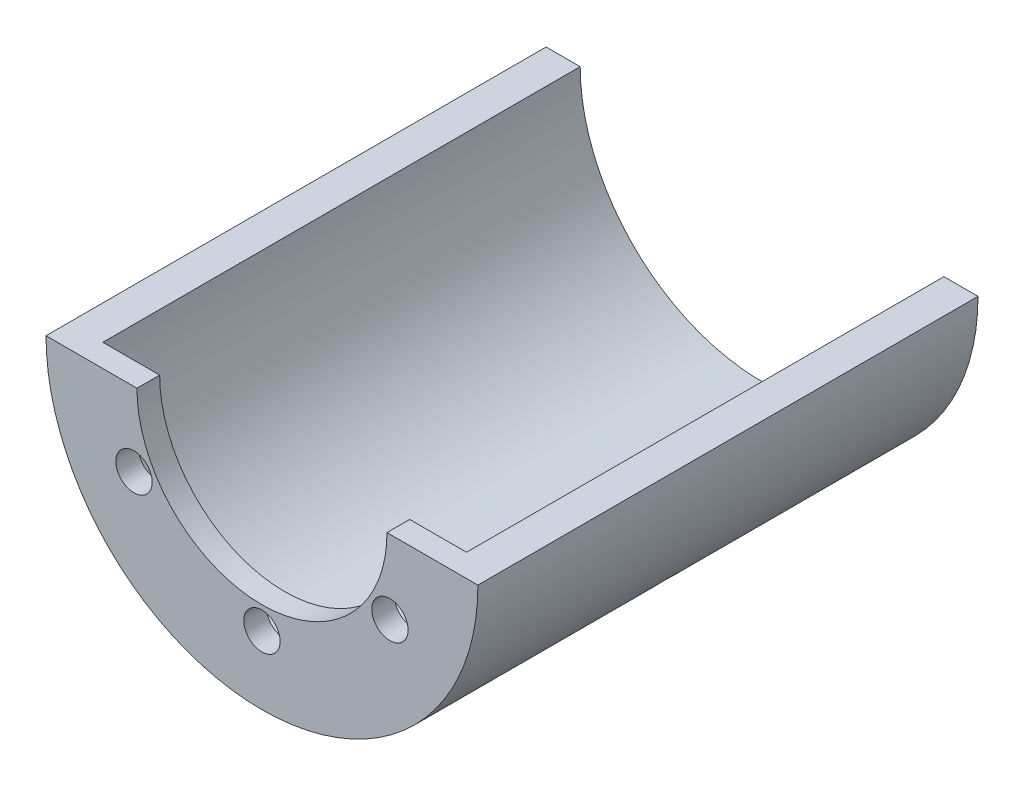
ISO-10303-21;
HEADER;
FILE_DESCRIPTION(('STEP AP214'),'2;1');
FILE_NAME('part.step','',(''),(''),'','','');
FILE_SCHEMA(('AUTOMOTIVE_DESIGN { 1 0 10303 214 1 1 1 1 }'));
ENDSEC;
DATA;
#1=APPLICATION_CONTEXT('core data for automotive mechanical design processes');
#2=APPLICATION_PROTOCOL_DEFINITION('international standard','automotive_design',2000,#1);
#3=PRODUCT_CONTEXT('',#1,'mechanical');
#4=PRODUCT('Part','Part','',(#3));
#5=PRODUCT_RELATED_PRODUCT_CATEGORY('part','',(#4));
#6=PRODUCT_DEFINITION_FORMATION('','',#4);
#7=PRODUCT_DEFINITION_CONTEXT('part definition',#1,'design');
#8=PRODUCT_DEFINITION('design','',#6,#7);
#9=PRODUCT_DEFINITION_SHAPE('','',#8);
#10=(LENGTH_UNIT() NAMED_UNIT(*) SI_UNIT(.MILLI.,.METRE.));
#11=(NAMED_UNIT(*) PLANE_ANGLE_UNIT() SI_UNIT($,.RADIAN.));
#12=(NAMED_UNIT(*) SI_UNIT($,.STERADIAN.) SOLID_ANGLE_UNIT());
#13=UNCERTAINTY_MEASURE_WITH_UNIT(LENGTH_MEASURE(1.E-05),#10,'distance_accuracy_value','');
#14=(GEOMETRIC_REPRESENTATION_CONTEXT(3) GLOBAL_UNCERTAINTY_ASSIGNED_CONTEXT((#13)) GLOBAL_UNIT_ASSIGNED_CONTEXT((#10,
#11,#12)) REPRESENTATION_CONTEXT('',''));
#15=CARTESIAN_POINT('',(0.,0.,0.));
#16=DIRECTION('',(0.,0.,1.));
#17=DIRECTION('',(1.,0.,0.));
#18=AXIS2_PLACEMENT_3D('',#15,#16,#17);
#19=CARTESIAN_POINT('',(-9.5,0.,0.));
#20=DIRECTION('',(0.,-1.,0.));
#21=DIRECTION('',(0.,0.,-1.));
#22=AXIS2_PLACEMENT_3D('',#19,#20,#21);
#23=PLANE('',#22);
#24=DIRECTION('',(-1.,0.,0.));
#25=VECTOR('',#24,1.);
#26=CARTESIAN_POINT('',(0.,0.,21.));
#27=LINE('',#26,#25);
#28=CARTESIAN_POINT('',(8.,0.,21.));
#29=VERTEX_POINT('',#28);
#30=CARTESIAN_POINT('',(5.5,0.,21.));
#31=VERTEX_POINT('',#30);
#32=EDGE_CURVE('E105',#29,#31,#27,.T.);
#33=ORIENTED_EDGE('',*,*,#32,.T.);
#34=DIRECTION('',(0.,0.,1.));
#35=VECTOR('',#34,1.);
#36=CARTESIAN_POINT('',(5.5,0.,0.));
#37=LINE('',#36,#35);
#38=CARTESIAN_POINT('',(5.5,0.,22.));
#39=VERTEX_POINT('',#38);
#40=EDGE_CURVE('E96',#31,#39,#37,.T.);
#41=ORIENTED_EDGE('',*,*,#40,.T.);
#42=DIRECTION('',(-1.,0.,0.));
#43=VECTOR('',#42,1.);
#44=CARTESIAN_POINT('',(0.,0.,22.));
#45=LINE('',#44,#43);
#46=CARTESIAN_POINT('',(9.5,0.,22.));
#47=VERTEX_POINT('',#46);
#48=EDGE_CURVE('E103',#47,#39,#45,.T.);
#49=ORIENTED_EDGE('',*,*,#48,.F.);
#50=DIRECTION('',(0.,0.,1.));
#51=VECTOR('',#50,1.);
#52=CARTESIAN_POINT('',(9.5,0.,0.));
#53=LINE('',#52,#51);
#54=CARTESIAN_POINT('',(9.5,0.,0.));
#55=VERTEX_POINT('',#54);
#56=EDGE_CURVE('E122',#55,#47,#53,.T.);
#57=ORIENTED_EDGE('',*,*,#56,.F.);
#58=DIRECTION('',(1.,0.,0.));
#59=VECTOR('',#58,1.);
#60=CARTESIAN_POINT('',(-9.5,0.,0.));
#61=LINE('',#60,#59);
#62=CARTESIAN_POINT('',(8.,0.,0.));
#63=VERTEX_POINT('',#62);
#64=EDGE_CURVE('E66',#63,#55,#61,.T.);
#65=ORIENTED_EDGE('',*,*,#64,.F.);
#66=DIRECTION('',(0.,0.,1.));
#67=VECTOR('',#66,1.);
#68=CARTESIAN_POINT('',(8.,0.,0.));
#69=LINE('',#68,#67);
#70=EDGE_CURVE('E52',#29,#63,#69,.F.);
#71=ORIENTED_EDGE('',*,*,#70,.F.);
#72=EDGE_LOOP('',(#33,#41,#49,#57,#65,#71));
#73=FACE_BOUND('',#72,.T.);
#74=ADVANCED_FACE('F43',(#73),#23,.F.);
#75=CARTESIAN_POINT('',(0.,0.,21.));
#76=DIRECTION('',(0.,0.,-1.));
#77=DIRECTION('',(-1.,0.,0.));
#78=AXIS2_PLACEMENT_3D('',#75,#76,#77);
#79=CYLINDRICAL_SURFACE('',#78,9.5);
#80=CARTESIAN_POINT('',(0.,0.,0.));
#81=DIRECTION('',(0.,0.,1.));
#82=DIRECTION('',(1.,0.,0.));
#83=AXIS2_PLACEMENT_3D('',#80,#81,#82);
#84=CIRCLE('',#83,9.5);
#85=CARTESIAN_POINT('',(-9.5,0.,0.));
#86=VERTEX_POINT('',#85);
#87=EDGE_CURVE('E130',#86,#55,#84,.T.);
#88=ORIENTED_EDGE('',*,*,#87,.T.);
#89=ORIENTED_EDGE('',*,*,#56,.T.);
#90=CARTESIAN_POINT('',(0.,0.,22.));
#91=DIRECTION('',(0.,0.,1.));
#92=DIRECTION('',(1.,0.,0.));
#93=AXIS2_PLACEMENT_3D('',#90,#91,#92);
#94=CIRCLE('',#93,9.5);
#95=CARTESIAN_POINT('',(-9.5,0.,22.));
#96=VERTEX_POINT('',#95);
#97=EDGE_CURVE('E110',#96,#47,#94,.T.);
#98=ORIENTED_EDGE('',*,*,#97,.F.);
#99=DIRECTION('',(0.,0.,1.));
#100=VECTOR('',#99,1.);
#101=CARTESIAN_POINT('',(-9.5,0.,0.));
#102=LINE('',#101,#100);
#103=EDGE_CURVE('E121',#86,#96,#102,.T.);
#104=ORIENTED_EDGE('',*,*,#103,.F.);
#105=EDGE_LOOP('',(#88,#89,#98,#104));
#106=FACE_BOUND('',#105,.T.);
#107=CARTESIAN_POINT('',(0.,-9.5,10.5));
#108=CARTESIAN_POINT('',(0.02806437374378,-9.49999982417539,10.5000012378692));
#109=CARTESIAN_POINT('',(0.0561486015241214,-9.49987430915388,10.5023707637978));
#110=CARTESIAN_POINT('',(0.111542173551061,-9.4993856714155,10.5117895905077));
#111=CARTESIAN_POINT('',(0.138850567542478,-9.49902226940258,10.5188443922739));
#112=CARTESIAN_POINT('',(0.191882035677595,-9.49809898475712,10.5374311004004));
#113=CARTESIAN_POINT('',(0.217605915366788,-9.4975392029469,10.5489607096953));
#114=CARTESIAN_POINT('',(0.266746275152561,-9.49628618729889,10.5761661820666));
#115=CARTESIAN_POINT('',(0.290163295043532,-9.4955929847936,10.5918410719887));
#116=CARTESIAN_POINT('',(0.334057985296606,-9.49415024136152,10.6269113399686));
#117=CARTESIAN_POINT('',(0.354532789417466,-9.49340064656696,10.6463103035454));
#118=CARTESIAN_POINT('',(0.391937397250838,-9.49193006589218,10.6882708355722));
#119=CARTESIAN_POINT('',(0.40886705552236,-9.49120908118667,10.7108325337113));
#120=CARTESIAN_POINT('',(0.438708940361449,-9.48987663413122,10.7584934312751));
#121=CARTESIAN_POINT('',(0.45161889236729,-9.48926523387266,10.7835940567556));
#122=CARTESIAN_POINT('',(0.473040316223046,-9.48822156888617,10.8356102657882));
#123=CARTESIAN_POINT('',(0.481551824118955,-9.4877893026902,10.8625258344646));
#124=CARTESIAN_POINT('',(0.493927079050541,-9.48715314541049,10.9173812075266));
#125=CARTESIAN_POINT('',(0.497795166530737,-9.48694904106439,10.9453200302044));
#126=CARTESIAN_POINT('',(0.500787173213216,-9.48679158412781,11.0014511171714));
#127=CARTESIAN_POINT('',(0.499911132980883,-9.48683822939327,11.0296433792915));
#128=CARTESIAN_POINT('',(0.493443364229649,-9.487176813379,11.0854515538363));
#129=CARTESIAN_POINT('',(0.487856326687887,-9.48746850809015,11.1130680115974));
#130=CARTESIAN_POINT('',(0.472132429623408,-9.48826393070847,11.1669705353135));
#131=CARTESIAN_POINT('',(0.461995549327281,-9.48876765958374,11.1932565951936));
#132=CARTESIAN_POINT('',(0.437454364376614,-9.48993065858389,11.2437672633556));
#133=CARTESIAN_POINT('',(0.423047923110689,-9.49059000655133,11.2679908316756));
#134=CARTESIAN_POINT('',(0.390378116957728,-9.49198985178424,11.3136775251558));
#135=CARTESIAN_POINT('',(0.372114721748612,-9.49273034968766,11.335140628612));
#136=CARTESIAN_POINT('',(0.332222976424407,-9.49421012015096,11.3747244346757));
#137=CARTESIAN_POINT('',(0.310590564570645,-9.49494939012866,11.3928410442963));
#138=CARTESIAN_POINT('',(0.264589118476257,-9.49634251781153,11.4251860531828));
#139=CARTESIAN_POINT('',(0.240220083514053,-9.49699637549418,11.4394144514235));
#140=CARTESIAN_POINT('',(0.189434727239682,-9.49814502286204,11.4635787620596));
#141=CARTESIAN_POINT('',(0.163018336725353,-9.49863980716753,11.4735145292861));
#142=CARTESIAN_POINT('',(0.108889204661846,-9.49941446923238,11.4888088513594));
#143=CARTESIAN_POINT('',(0.0811764738627556,-9.49969434877353,11.4941674441559));
#144=CARTESIAN_POINT('',(0.0252768524688078,-9.50000743022508,11.5001502568009));
#145=CARTESIAN_POINT('',(-0.00290943067616406,-9.50004092708659,11.5007801375321));
#146=CARTESIAN_POINT('',(-0.058987284177098,-9.49985825150628,11.4973024225252));
#147=CARTESIAN_POINT('',(-0.0868788556145619,-9.49964207998099,11.4931948441782));
#148=CARTESIAN_POINT('',(-0.14155966755875,-9.49898460304193,11.4803634958128));
#149=CARTESIAN_POINT('',(-0.168349516808166,-9.49854342380968,11.4716423129443));
#150=CARTESIAN_POINT('',(-0.220085178079875,-9.49748559511935,11.4498339416642));
#151=CARTESIAN_POINT('',(-0.245030978331784,-9.49686894454137,11.4367467253875));
#152=CARTESIAN_POINT('',(-0.29239640139273,-9.4955287928075,11.4065633078934));
#153=CARTESIAN_POINT('',(-0.314813604855771,-9.49480519082475,11.3894633146517));
#154=CARTESIAN_POINT('',(-0.356461160791032,-9.49333295354143,11.3517452855453));
#155=CARTESIAN_POINT('',(-0.375691490725259,-9.49258431806387,11.3311272248023));
#156=CARTESIAN_POINT('',(-0.410438502169432,-9.49114554822912,11.2869339655433));
#157=CARTESIAN_POINT('',(-0.425951519155961,-9.49045547202879,11.2633558836407));
#158=CARTESIAN_POINT('',(-0.452798497658292,-9.48921255480619,11.213926431084));
#159=CARTESIAN_POINT('',(-0.464132478827489,-9.48865971313852,11.1880750711215));
#160=CARTESIAN_POINT('',(-0.482293274300072,-9.48775402321393,11.1348464271318));
#161=CARTESIAN_POINT('',(-0.48912241901439,-9.48740107156468,11.1074699400345));
#162=CARTESIAN_POINT('',(-0.498087307063366,-9.4869346732781,11.0519570236124));
#163=CARTESIAN_POINT('',(-0.500223080862437,-9.48682122508618,11.0238205992214));
#164=CARTESIAN_POINT('',(-0.499740312747872,-9.48684666521667,10.9676229657103));
#165=CARTESIAN_POINT('',(-0.497127534854744,-9.48698524761236,10.9395617067529));
#166=CARTESIAN_POINT('',(-0.487233752519638,-9.48749848336143,10.8842768448009));
#167=CARTESIAN_POINT('',(-0.479952739256008,-9.48787313716092,10.8570532433895));
#168=CARTESIAN_POINT('',(-0.460930372457053,-9.48881622031361,10.8042153436986));
#169=CARTESIAN_POINT('',(-0.449188996588121,-9.48938465063708,10.7786010534778));
#170=CARTESIAN_POINT('',(-0.421580140583318,-9.49065120578611,10.7297068581676));
#171=CARTESIAN_POINT('',(-0.405712783247595,-9.49134932675156,10.7064268836313));
#172=CARTESIAN_POINT('',(-0.370281555360778,-9.49279755386647,10.6628332432913));
#173=CARTESIAN_POINT('',(-0.350713626453981,-9.49354771651183,10.6425228779834));
#174=CARTESIAN_POINT('',(-0.308440150857714,-9.49501505946994,10.6054689453043));
#175=CARTESIAN_POINT('',(-0.285733834285301,-9.49573223163202,10.5887262556948));
#176=CARTESIAN_POINT('',(-0.237808779372734,-9.4970533231912,10.5592742530006));
#177=CARTESIAN_POINT('',(-0.21258752349982,-9.49765712732497,10.5465690358989));
#178=CARTESIAN_POINT('',(-0.16038543473658,-9.49868176150433,10.5255887493123));
#179=CARTESIAN_POINT('',(-0.133406719184861,-9.49910280720937,10.5173084556261));
#180=CARTESIAN_POINT('',(-0.0885507259427026,-9.49960331308138,10.5075812004463));
#181=CARTESIAN_POINT('',(-0.0709638776506746,-9.49975141551155,10.5047418887769));
#182=CARTESIAN_POINT('',(-0.0355873477114517,-9.49994981467591,10.5009508969408));
#183=CARTESIAN_POINT('',(-0.0177976662573907,-9.50000011150321,10.4999992149769));
#184=CARTESIAN_POINT('',(0.,-9.5,10.5));
#185=B_SPLINE_CURVE_WITH_KNOTS('',3,(#107,#108,#109,#110,#111,#112,#113,#114,#115,#116,#117,
#118,#119,#120,#121,#122,#123,#124,#125,#126,#127,#128,#129,#130,#131,#132,#133,#134,#135,#136,
#137,#138,#139,#140,#141,#142,#143,#144,#145,#146,#147,#148,#149,#150,#151,#152,#153,#154,#155,
#156,#157,#158,#159,#160,#161,#162,#163,#164,#165,#166,#167,#168,#169,#170,#171,#172,#173,#174,
#175,#176,#177,#178,#179,#180,#181,#182,#183,#184),.UNSPECIFIED.,.T.,.F.,(4,2,2,2,2,2,2,2,2,2,2,
2,2,2,2,2,2,2,2,2,2,2,2,2,2,2,2,2,2,2,2,2,2,2,2,2,2,2,4),(0.,0.0841281523620635,
0.168355254670591,0.252539177512006,0.336703354684926,0.420948974824851,0.505198050497354,
0.589494712463816,0.673790683593901,0.758007797423267,0.84222419114257,0.926356825254627,
1.01048984349853,1.09466503562789,1.17884088953903,1.26311902419396,1.34739718107093,
1.43167818785664,1.51595849585396,1.60013789326003,1.68431698164614,1.7684489152687,
1.85258138585082,1.93679368302409,2.02100657573252,2.10530214701305,2.18959732185875,
2.27384885543664,2.35809984214083,2.44224862923933,2.52639757535585,2.61054694282249,
2.6946938060674,2.77893349263282,2.86319388097028,2.94753947989139,3.03178527654356,
3.08513712461363,3.13848892188732),.UNSPECIFIED.);
#186=CARTESIAN_POINT('',(0.,-9.5,10.5));
#187=VERTEX_POINT('',#186);
#188=EDGE_CURVE('E139',#187,#187,#185,.T.);
#189=ORIENTED_EDGE('',*,*,#188,.F.);
#190=EDGE_LOOP('',(#189));
#191=FACE_BOUND('',#190,.T.);
#192=CARTESIAN_POINT('',(-6.35465054190611,-7.06175732309263,11.));
#193=CARTESIAN_POINT('',(-6.35465154220356,-7.06175657273972,11.028064343385));
#194=CARTESIAN_POINT('',(-6.35641592532297,-7.06016994715919,11.0561485409097));
#195=CARTESIAN_POINT('',(-6.36342199647877,-7.05385581619449,11.1115420500699));
#196=CARTESIAN_POINT('',(-6.36866777210134,-7.0491246186835,11.1388504114265));
#197=CARTESIAN_POINT('',(-6.38246409174174,-7.03663543150113,11.1918818105769));
#198=CARTESIAN_POINT('',(-6.39101293959046,-7.02887899530854,11.2176056541926));
#199=CARTESIAN_POINT('',(-6.41113672515842,-7.01052854069149,11.2667459536218));
#200=CARTESIAN_POINT('',(-6.42271095268278,-6.99993518820662,11.2901629491841));
#201=CARTESIAN_POINT('',(-6.44852983100865,-6.97615728024626,11.3340576672615));
#202=CARTESIAN_POINT('',(-6.46277706203213,-6.96297022049297,11.3545325157452));
#203=CARTESIAN_POINT('',(-6.49348735976031,-6.93433931168885,11.3919372090987));
#204=CARTESIAN_POINT('',(-6.50995051724384,-6.91889537017919,11.4088669086634));
#205=CARTESIAN_POINT('',(-6.54459349171325,-6.88613562281055,11.4387088364079));
#206=CARTESIAN_POINT('',(-6.56277426983329,-6.86881876812569,11.4516187976867));
#207=CARTESIAN_POINT('',(-6.60029252833858,-6.83277502482523,11.4730402410661));
#208=CARTESIAN_POINT('',(-6.61962999927263,-6.81404814773045,11.4815517591004));
#209=CARTESIAN_POINT('',(-6.65886785415703,-6.77570883162278,11.4939270356248));
#210=CARTESIAN_POINT('',(-6.67876769449328,-6.75609723757361,11.4977951353068));
#211=CARTESIAN_POINT('',(-6.71856952657173,-6.7165177790099,11.5007871731441));
#212=CARTESIAN_POINT('',(-6.73847151829415,-6.69654991753344,11.4999111517358));
#213=CARTESIAN_POINT('',(-6.77769482493045,-6.65684842830242,11.4934434124894));
#214=CARTESIAN_POINT('',(-6.79701669551117,-6.63711458811809,11.4878563666879));
#215=CARTESIAN_POINT('',(-6.83456988023624,-6.59843781546528,11.4721324182671));
#216=CARTESIAN_POINT('',(-6.85280118944513,-6.57949488657629,11.4619954950585));
#217=CARTESIAN_POINT('',(-6.88769604346467,-6.54295670576365,11.4374542218727));
#218=CARTESIAN_POINT('',(-6.9043588015795,-6.52536213091128,11.4230477453982));
#219=CARTESIAN_POINT('',(-6.93567479735298,-6.49206733810532,11.3903778644291));
#220=CARTESIAN_POINT('',(-6.9503280192005,-6.47636713505685,11.3721144295905));
#221=CARTESIAN_POINT('',(-6.97727159773498,-6.44733082308248,11.3322226565216));
#222=CARTESIAN_POINT('',(-6.98955906743825,-6.43399760417035,11.3105902645492));
#223=CARTESIAN_POINT('',(-7.01144483255483,-6.41014073957085,11.2645888748318));
#224=CARTESIAN_POINT('',(-7.02104312719381,-6.39961709469248,11.2402198762987));
#225=CARTESIAN_POINT('',(-7.03731693003116,-6.38171744053804,11.1894345291109));
#226=CARTESIAN_POINT('',(-7.04399233122437,-6.37434154649925,11.1630181055429));
#227=CARTESIAN_POINT('',(-7.05425862588061,-6.36297842088973,11.1088889017512));
#228=CARTESIAN_POINT('',(-7.05784954504927,-6.35899116107859,11.0811761323332));
#229=CARTESIAN_POINT('',(-7.06185832260148,-6.35453902261716,11.0252764942239));
#230=CARTESIAN_POINT('',(-7.06227998203385,-6.3540699244643,10.99709023411));
#231=CARTESIAN_POINT('',(-7.05995019371922,-6.35665841282309,10.9410124315039));
#232=CARTESIAN_POINT('',(-7.05719875761936,-6.35971598638977,10.9131208879302));
#233=CARTESIAN_POINT('',(-7.04859111071311,-6.36925460006995,10.8584402082695));
#234=CARTESIAN_POINT('',(-7.0427366479341,-6.37573371272102,10.8316504606547));
#235=CARTESIAN_POINT('',(-7.02806458321128,-6.39190321486289,10.7799149902102));
#236=CARTESIAN_POINT('',(-7.01924696224449,-6.40159362496967,10.75496927922));
#237=CARTESIAN_POINT('',(-6.99885230952174,-6.42388464312873,10.7076039150465));
#238=CARTESIAN_POINT('',(-6.98727265668256,-6.4364880151376,10.6851866912637));
#239=CARTESIAN_POINT('',(-6.96164316368557,-6.46419985167398,10.6435390885464));
#240=CARTESIAN_POINT('',(-6.94759330612678,-6.47930833384831,10.6243087320631));
#241=CARTESIAN_POINT('',(-6.91736097684475,-6.51157472812046,10.5895616659962));
#242=CARTESIAN_POINT('',(-6.90117642484397,-6.52873463780426,10.5740486210436));
#243=CARTESIAN_POINT('',(-6.86710271414884,-6.56456477644009,10.5472015934148));
#244=CARTESIAN_POINT('',(-6.84921356347212,-6.58323499828825,10.5358675910837));
#245=CARTESIAN_POINT('',(-6.81221495709166,-6.6215130408955,10.5177067809972));
#246=CARTESIAN_POINT('',(-6.79310614047711,-6.64112036929157,10.5108776336779));
#247=CARTESIAN_POINT('',(-6.75418199862651,-6.68070323245827,10.5019127273912));
#248=CARTESIAN_POINT('',(-6.73436667794655,-6.70067876485402,10.4997769381628));
#249=CARTESIAN_POINT('',(-6.69461096754728,-6.74039855052114,10.5002596624426));
#250=CARTESIAN_POINT('',(-6.67467075802976,-6.76014305424249,10.5028724303065));
#251=CARTESIAN_POINT('',(-6.63521591386142,-6.79887301557055,10.5127662175745));
#252=CARTESIAN_POINT('',(-6.6157012800033,-6.81785847176347,10.5200472456733));
#253=CARTESIAN_POINT('',(-6.57767299087183,-6.85455445897471,10.5390696685087));
#254=CARTESIAN_POINT('',(-6.55915934062526,-6.87226498359068,10.5508110856422));
#255=CARTESIAN_POINT('',(-6.5236908853176,-6.90594353442475,10.578420045585));
#256=CARTESIAN_POINT('',(-6.50673603385471,-6.92191161251407,10.5942874655189));
#257=CARTESIAN_POINT('',(-6.47488691710464,-6.95171320444404,10.6297187609478));
#258=CARTESIAN_POINT('',(-6.45999493739193,-6.96554435258261,10.6492866805766));
#259=CARTESIAN_POINT('',(-6.43275615938787,-6.99070762124849,10.6915601185345));
#260=CARTESIAN_POINT('',(-6.420409987557,-7.00203912672321,10.7142664068481));
#261=CARTESIAN_POINT('',(-6.39864957223336,-7.02193006905911,10.7621914400729));
#262=CARTESIAN_POINT('',(-6.38923831234918,-7.03048668533988,10.7874127075496));
#263=CARTESIAN_POINT('',(-6.37367777512875,-7.04459672286786,10.8396148211817));
#264=CARTESIAN_POINT('',(-6.36752465110208,-7.05015368578173,10.8665935499331));
#265=CARTESIAN_POINT('',(-6.36029211007674,-7.05667751256781,10.9114495114474));
#266=CARTESIAN_POINT('',(-6.35817956055844,-7.05858033438015,10.9290363123942));
#267=CARTESIAN_POINT('',(-6.35535845996435,-7.06112047696367,10.9644127474169));
#268=CARTESIAN_POINT('',(-6.35464990754554,-7.06175779894538,10.9822023812987));
#269=CARTESIAN_POINT('',(-6.35465054190611,-7.06175732309263,11.));
#270=B_SPLINE_CURVE_WITH_KNOTS('',3,(#192,#193,#194,#195,#196,#197,#198,#199,#200,#201,#202,
#203,#204,#205,#206,#207,#208,#209,#210,#211,#212,#213,#214,#215,#216,#217,#218,#219,#220,#221,
#222,#223,#224,#225,#226,#227,#228,#229,#230,#231,#232,#233,#234,#235,#236,#237,#238,#239,#240,
#241,#242,#243,#244,#245,#246,#247,#248,#249,#250,#251,#252,#253,#254,#255,#256,#257,#258,#259,
#260,#261,#262,#263,#264,#265,#266,#267,#268,#269),.UNSPECIFIED.,.T.,.F.,(4,2,2,2,2,2,2,2,2,2,2,
2,2,2,2,2,2,2,2,2,2,2,2,2,2,2,2,2,2,2,2,2,2,2,2,2,2,2,4),(0.,0.0841280611865347,
0.16835507430879,0.252538893161789,0.336702967945074,0.420948707358393,0.505197899078118,
0.589494516800737,0.67379044583963,0.758007503993816,0.842223844326519,0.926356763379637,
1.01049006315719,1.09466533705781,1.17884127321567,1.26311928909206,1.34739732923558,
1.43167845448323,1.51595887733687,1.60013820238681,1.68431721844959,1.76844886428561,
1.85258105024298,1.93679339493885,2.02100633287939,2.10530195188413,2.18959717442123,
2.27384858430576,2.35809945096776,2.44224844388772,2.52639759353463,2.6105471657256,
2.69469423216849,2.77893379678112,2.86319406599818,2.94753971639794,3.03178556152449,
3.08513726716718,3.13848892177519),.UNSPECIFIED.);
#271=CARTESIAN_POINT('',(-6.35465054190611,-7.06175732309263,11.));
#272=VERTEX_POINT('',#271);
#273=EDGE_CURVE('E147',#272,#272,#270,.T.);
#274=ORIENTED_EDGE('',*,*,#273,.F.);
#275=EDGE_LOOP('',(#274));
#276=FACE_BOUND('',#275,.T.);
#277=CARTESIAN_POINT('',(7.06175732309265,-6.35465054190608,11.));
#278=CARTESIAN_POINT('',(7.06175657273975,-6.35465154220353,11.028064343385));
#279=CARTESIAN_POINT('',(7.06016994715921,-6.35641592532295,11.0561485409097));
#280=CARTESIAN_POINT('',(7.05385581619452,-6.36342199647875,11.1115420500699));
#281=CARTESIAN_POINT('',(7.04912461868352,-6.36866777210132,11.1388504114265));
#282=CARTESIAN_POINT('',(7.03663543150115,-6.38246409174171,11.1918818105769));
#283=CARTESIAN_POINT('',(7.02887899530856,-6.39101293959044,11.2176056541926));
#284=CARTESIAN_POINT('',(7.01052854069151,-6.4111367251584,11.2667459536218));
#285=CARTESIAN_POINT('',(6.99993518820665,-6.42271095268276,11.2901629491841));
#286=CARTESIAN_POINT('',(6.97615728024628,-6.44852983100863,11.3340576672615));
#287=CARTESIAN_POINT('',(6.96297022049299,-6.4627770620321,11.3545325157452));
#288=CARTESIAN_POINT('',(6.93433931168887,-6.49348735976029,11.3919372090987));
#289=CARTESIAN_POINT('',(6.91889537017922,-6.50995051724382,11.4088669086634));
#290=CARTESIAN_POINT('',(6.88613562281058,-6.54459349171322,11.4387088364079));
#291=CARTESIAN_POINT('',(6.86881876812571,-6.56277426983327,11.4516187976867));
#292=CARTESIAN_POINT('',(6.83277502482526,-6.60029252833856,11.4730402410661));
#293=CARTESIAN_POINT('',(6.81404814773047,-6.61962999927261,11.4815517591004));
#294=CARTESIAN_POINT('',(6.7757088316228,-6.65886785415701,11.4939270356248));
#295=CARTESIAN_POINT('',(6.75609723757364,-6.67876769449326,11.4977951353068));
#296=CARTESIAN_POINT('',(6.71651777900993,-6.71856952657171,11.5007871731441));
#297=CARTESIAN_POINT('',(6.69654991753346,-6.73847151829412,11.4999111517358));
#298=CARTESIAN_POINT('',(6.65684842830244,-6.77769482493043,11.4934434124894));
#299=CARTESIAN_POINT('',(6.63711458811811,-6.79701669551115,11.4878563666879));
#300=CARTESIAN_POINT('',(6.5984378154653,-6.83456988023622,11.4721324182671));
#301=CARTESIAN_POINT('',(6.57949488657631,-6.85280118944511,11.4619954950585));
#302=CARTESIAN_POINT('',(6.54295670576367,-6.88769604346465,11.4374542218727));
#303=CARTESIAN_POINT('',(6.5253621309113,-6.90435880157948,11.4230477453982));
#304=CARTESIAN_POINT('',(6.49206733810534,-6.93567479735296,11.3903778644291));
#305=CARTESIAN_POINT('',(6.47636713505687,-6.95032801920047,11.3721144295905));
#306=CARTESIAN_POINT('',(6.4473308230825,-6.97727159773496,11.3322226565216));
#307=CARTESIAN_POINT('',(6.43399760417037,-6.98955906743823,11.3105902645492));
#308=CARTESIAN_POINT('',(6.41014073957088,-7.01144483255481,11.2645888748318));
#309=CARTESIAN_POINT('',(6.39961709469251,-7.02104312719379,11.2402198762987));
#310=CARTESIAN_POINT('',(6.38171744053807,-7.03731693003114,11.1894345291109));
#311=CARTESIAN_POINT('',(6.37434154649928,-7.04399233122435,11.1630181055429));
#312=CARTESIAN_POINT('',(6.36297842088975,-7.05425862588059,11.1088889017512));
#313=CARTESIAN_POINT('',(6.35899116107861,-7.05784954504925,11.0811761323332));
#314=CARTESIAN_POINT('',(6.35453902261718,-7.06185832260146,11.0252764942239));
#315=CARTESIAN_POINT('',(6.35406992446432,-7.06227998203383,10.99709023411));
#316=CARTESIAN_POINT('',(6.35665841282312,-7.05995019371919,10.9410124315039));
#317=CARTESIAN_POINT('',(6.3597159863898,-7.05719875761934,10.9131208879302));
#318=CARTESIAN_POINT('',(6.36925460006998,-7.04859111071309,10.8584402082695));
#319=CARTESIAN_POINT('',(6.37573371272104,-7.04273664793408,10.8316504606547));
#320=CARTESIAN_POINT('',(6.39190321486291,-7.02806458321126,10.7799149902102));
#321=CARTESIAN_POINT('',(6.4015936249697,-7.01924696224447,10.75496927922));
#322=CARTESIAN_POINT('',(6.42388464312875,-6.99885230952172,10.7076039150465));
#323=CARTESIAN_POINT('',(6.43648801513762,-6.98727265668253,10.6851866912637));
#324=CARTESIAN_POINT('',(6.46419985167401,-6.96164316368554,10.6435390885464));
#325=CARTESIAN_POINT('',(6.47930833384834,-6.94759330612676,10.6243087320631));
#326=CARTESIAN_POINT('',(6.51157472812049,-6.91736097684472,10.5895616659962));
#327=CARTESIAN_POINT('',(6.52873463780429,-6.90117642484395,10.5740486210436));
#328=CARTESIAN_POINT('',(6.56456477644012,-6.86710271414882,10.5472015934148));
#329=CARTESIAN_POINT('',(6.58323499828828,-6.8492135634721,10.5358675910837));
#330=CARTESIAN_POINT('',(6.62151304089552,-6.81221495709163,10.5177067809972));
#331=CARTESIAN_POINT('',(6.64112036929159,-6.79310614047709,10.5108776336779));
#332=CARTESIAN_POINT('',(6.68070323245829,-6.75418199862649,10.5019127273912));
#333=CARTESIAN_POINT('',(6.70067876485404,-6.73436667794653,10.4997769381628));
#334=CARTESIAN_POINT('',(6.74039855052116,-6.69461096754726,10.5002596624426));
#335=CARTESIAN_POINT('',(6.76014305424251,-6.67467075802974,10.5028724303065));
#336=CARTESIAN_POINT('',(6.79887301557057,-6.6352159138614,10.5127662175745));
#337=CARTESIAN_POINT('',(6.81785847176349,-6.61570128000327,10.5200472456733));
#338=CARTESIAN_POINT('',(6.85455445897473,-6.5776729908718,10.5390696685087));
#339=CARTESIAN_POINT('',(6.8722649835907,-6.55915934062524,10.5508110856422));
#340=CARTESIAN_POINT('',(6.90594353442478,-6.52369088531758,10.578420045585));
#341=CARTESIAN_POINT('',(6.92191161251409,-6.50673603385469,10.5942874655189));
#342=CARTESIAN_POINT('',(6.95171320444406,-6.47488691710462,10.6297187609478));
#343=CARTESIAN_POINT('',(6.96554435258263,-6.4599949373919,10.6492866805766));
#344=CARTESIAN_POINT('',(6.99070762124852,-6.43275615938785,10.6915601185345));
#345=CARTESIAN_POINT('',(7.00203912672323,-6.42040998755698,10.7142664068481));
#346=CARTESIAN_POINT('',(7.02193006905913,-6.39864957223334,10.7621914400729));
#347=CARTESIAN_POINT('',(7.03048668533991,-6.38923831234916,10.7874127075496));
#348=CARTESIAN_POINT('',(7.04459672286789,-6.37367777512872,10.8396148211817));
#349=CARTESIAN_POINT('',(7.05015368578175,-6.36752465110206,10.8665935499331));
#350=CARTESIAN_POINT('',(7.05667751256783,-6.36029211007671,10.9114495114474));
#351=CARTESIAN_POINT('',(7.05858033438018,-6.35817956055842,10.9290363123942));
#352=CARTESIAN_POINT('',(7.06112047696369,-6.35535845996433,10.9644127474169));
#353=CARTESIAN_POINT('',(7.0617577989454,-6.35464990754552,10.9822023812987));
#354=CARTESIAN_POINT('',(7.06175732309265,-6.35465054190608,11.));
#355=B_SPLINE_CURVE_WITH_KNOTS('',3,(#277,#278,#279,#280,#281,#282,#283,#284,#285,#286,#287,
#288,#289,#290,#291,#292,#293,#294,#295,#296,#297,#298,#299,#300,#301,#302,#303,#304,#305,#306,
#307,#308,#309,#310,#311,#312,#313,#314,#315,#316,#317,#318,#319,#320,#321,#322,#323,#324,#325,
#326,#327,#328,#329,#330,#331,#332,#333,#334,#335,#336,#337,#338,#339,#340,#341,#342,#343,#344,
#345,#346,#347,#348,#349,#350,#351,#352,#353,#354),.UNSPECIFIED.,.T.,.F.,(4,2,2,2,2,2,2,2,2,2,2,
2,2,2,2,2,2,2,2,2,2,2,2,2,2,2,2,2,2,2,2,2,2,2,2,2,2,2,4),(0.,0.0841280611865346,
0.16835507430879,0.25253889316179,0.336702967945077,0.420948707358393,0.505197899078118,
0.589494516800736,0.673790445839629,0.758007503993815,0.84222384432652,0.926356763379637,
1.01049006315719,1.09466533705781,1.17884127321567,1.26311928909206,1.34739732923558,
1.43167845448323,1.51595887733687,1.60013820238681,1.68431721844959,1.76844886428561,
1.85258105024298,1.93679339493885,2.02100633287939,2.10530195188413,2.18959717442123,
2.27384858430576,2.35809945096776,2.44224844388771,2.52639759353463,2.6105471657256,
2.69469423216849,2.77893379678112,2.86319406599818,2.94753971639794,3.03178556152448,
3.08513726716718,3.13848892177519),.UNSPECIFIED.);
#356=CARTESIAN_POINT('',(7.06175732309265,-6.35465054190608,11.));
#357=VERTEX_POINT('',#356);
#358=EDGE_CURVE('E295',#357,#357,#355,.T.);
#359=ORIENTED_EDGE('',*,*,#358,.F.);
#360=EDGE_LOOP('',(#359));
#361=FACE_BOUND('',#360,.T.);
#362=ADVANCED_FACE('F45',(#106,#191,#276,#361),#79,.T.);
#363=CARTESIAN_POINT('',(0.,0.,0.));
#364=DIRECTION('',(0.,0.,1.));
#365=DIRECTION('',(1.,0.,0.));
#366=AXIS2_PLACEMENT_3D('',#363,#364,#365);
#367=PLANE('',#366);
#368=ORIENTED_EDGE('',*,*,#87,.F.);
#369=CARTESIAN_POINT('',(-8.,0.,0.));
#370=VERTEX_POINT('',#369);
#371=EDGE_CURVE('E113',#86,#370,#61,.T.);
#372=ORIENTED_EDGE('',*,*,#371,.T.);
#373=CARTESIAN_POINT('',(0.,0.,0.));
#374=DIRECTION('',(0.,0.,1.));
#375=DIRECTION('',(1.,0.,0.));
#376=AXIS2_PLACEMENT_3D('',#373,#374,#375);
#377=CIRCLE('',#376,8.);
#378=EDGE_CURVE('E127',#370,#63,#377,.T.);
#379=ORIENTED_EDGE('',*,*,#378,.T.);
#380=ORIENTED_EDGE('',*,*,#64,.T.);
#381=EDGE_LOOP('',(#368,#372,#379,#380));
#382=FACE_BOUND('',#381,.T.);
#383=ADVANCED_FACE('F172',(#382),#367,.F.);
#384=CARTESIAN_POINT('',(0.,0.,0.));
#385=DIRECTION('',(0.,0.,1.));
#386=DIRECTION('',(1.,0.,0.));
#387=AXIS2_PLACEMENT_3D('',#384,#385,#386);
#388=CYLINDRICAL_SURFACE('',#387,8.);
#389=CARTESIAN_POINT('',(0.,0.,21.));
#390=DIRECTION('',(0.,0.,1.));
#391=DIRECTION('',(1.,0.,0.));
#392=AXIS2_PLACEMENT_3D('',#389,#390,#391);
#393=CIRCLE('',#392,8.);
#394=CARTESIAN_POINT('',(-8.,0.,21.));
#395=VERTEX_POINT('',#394);
#396=EDGE_CURVE('E124',#395,#29,#393,.T.);
#397=ORIENTED_EDGE('',*,*,#396,.T.);
#398=ORIENTED_EDGE('',*,*,#70,.T.);
#399=ORIENTED_EDGE('',*,*,#378,.F.);
#400=DIRECTION('',(0.,0.,1.));
#401=VECTOR('',#400,1.);
#402=CARTESIAN_POINT('',(-8.,0.,0.));
#403=LINE('',#402,#401);
#404=EDGE_CURVE('E135',#370,#395,#403,.T.);
#405=ORIENTED_EDGE('',*,*,#404,.T.);
#406=EDGE_LOOP('',(#397,#398,#399,#405));
#407=FACE_BOUND('',#406,.T.);
#408=ADVANCED_FACE('F169',(#407),#388,.F.);
#409=CARTESIAN_POINT('',(-5.5,0.,22.));
#410=VERTEX_POINT('',#409);
#411=EDGE_CURVE('E111',#410,#96,#45,.T.);
#412=ORIENTED_EDGE('',*,*,#411,.F.);
#413=DIRECTION('',(0.,0.,1.));
#414=VECTOR('',#413,1.);
#415=CARTESIAN_POINT('',(-5.5,0.,0.));
#416=LINE('',#415,#414);
#417=CARTESIAN_POINT('',(-5.5,0.,21.));
#418=VERTEX_POINT('',#417);
#419=EDGE_CURVE('E58',#410,#418,#416,.F.);
#420=ORIENTED_EDGE('',*,*,#419,.T.);
#421=EDGE_CURVE('E118',#418,#395,#27,.T.);
#422=ORIENTED_EDGE('',*,*,#421,.T.);
#423=ORIENTED_EDGE('',*,*,#404,.F.);
#424=ORIENTED_EDGE('',*,*,#371,.F.);
#425=ORIENTED_EDGE('',*,*,#103,.T.);
#426=EDGE_LOOP('',(#412,#420,#422,#423,#424,#425));
#427=FACE_BOUND('',#426,.T.);
#428=ADVANCED_FACE('F165',(#427),#23,.F.);
#429=CARTESIAN_POINT('',(0.,0.,21.));
#430=DIRECTION('',(0.,0.,1.));
#431=DIRECTION('',(1.,0.,0.));
#432=AXIS2_PLACEMENT_3D('',#429,#430,#431);
#433=PLANE('',#432);
#434=CARTESIAN_POINT('',(-5.62916512459881,-3.25000000000007,21.));
#435=DIRECTION('',(0.,0.,-1.));
#436=DIRECTION('',(-0.50000000000001,0.866025403784433,0.));
#437=AXIS2_PLACEMENT_3D('',#434,#435,#436);
#438=CIRCLE('',#437,0.8);
#439=CARTESIAN_POINT('',(-6.02916512459882,-2.55717967697252,21.));
#440=VERTEX_POINT('',#439);
#441=EDGE_CURVE('E329',#440,#440,#438,.T.);
#442=ORIENTED_EDGE('',*,*,#441,.F.);
#443=EDGE_LOOP('',(#442));
#444=FACE_BOUND('',#443,.T.);
#445=CARTESIAN_POINT('',(5.62916512459886,-3.24999999999999,21.));
#446=DIRECTION('',(0.,0.,-1.));
#447=DIRECTION('',(-0.499999999999998,-0.86602540378444,0.));
#448=AXIS2_PLACEMENT_3D('',#445,#446,#447);
#449=CIRCLE('',#448,0.8);
#450=CARTESIAN_POINT('',(5.22916512459886,-3.94282032302754,21.));
#451=VERTEX_POINT('',#450);
#452=EDGE_CURVE('E323',#451,#451,#449,.T.);
#453=ORIENTED_EDGE('',*,*,#452,.F.);
#454=EDGE_LOOP('',(#453));
#455=FACE_BOUND('',#454,.T.);
#456=CARTESIAN_POINT('',(0.,-6.5,21.));
#457=DIRECTION('',(0.,0.,-1.));
#458=DIRECTION('',(-1.,0.,0.));
#459=AXIS2_PLACEMENT_3D('',#456,#457,#458);
#460=CIRCLE('',#459,0.8);
#461=CARTESIAN_POINT('',(-0.8,-6.5,21.));
#462=VERTEX_POINT('',#461);
#463=EDGE_CURVE('E317',#462,#462,#460,.T.);
#464=ORIENTED_EDGE('',*,*,#463,.F.);
#465=EDGE_LOOP('',(#464));
#466=FACE_BOUND('',#465,.T.);
#467=ORIENTED_EDGE('',*,*,#421,.F.);
#468=CARTESIAN_POINT('',(0.,0.,21.));
#469=DIRECTION('',(0.,0.,1.));
#470=DIRECTION('',(1.,0.,0.));
#471=AXIS2_PLACEMENT_3D('',#468,#469,#470);
#472=CIRCLE('',#471,5.5);
#473=EDGE_CURVE('E314',#418,#31,#472,.T.);
#474=ORIENTED_EDGE('',*,*,#473,.T.);
#475=ORIENTED_EDGE('',*,*,#32,.F.);
#476=ORIENTED_EDGE('',*,*,#396,.F.);
#477=EDGE_LOOP('',(#467,#474,#475,#476));
#478=FACE_BOUND('',#477,.T.);
#479=ADVANCED_FACE('F161',(#444,#455,#466,#478),#433,.F.);
#480=CARTESIAN_POINT('',(0.,0.,22.));
#481=DIRECTION('',(0.,0.,1.));
#482=DIRECTION('',(1.,0.,0.));
#483=AXIS2_PLACEMENT_3D('',#480,#481,#482);
#484=PLANE('',#483);
#485=CARTESIAN_POINT('',(-5.62916512459881,-3.25000000000007,22.));
#486=DIRECTION('',(0.,0.,-1.));
#487=DIRECTION('',(-0.50000000000001,0.866025403784433,0.));
#488=AXIS2_PLACEMENT_3D('',#485,#486,#487);
#489=CIRCLE('',#488,0.8);
#490=CARTESIAN_POINT('',(-6.02916512459882,-2.55717967697252,22.));
#491=VERTEX_POINT('',#490);
#492=EDGE_CURVE('E326',#491,#491,#489,.T.);
#493=ORIENTED_EDGE('',*,*,#492,.T.);
#494=EDGE_LOOP('',(#493));
#495=FACE_BOUND('',#494,.T.);
#496=CARTESIAN_POINT('',(5.62916512459886,-3.24999999999999,22.));
#497=DIRECTION('',(0.,0.,-1.));
#498=DIRECTION('',(-0.499999999999998,-0.86602540378444,0.));
#499=AXIS2_PLACEMENT_3D('',#496,#497,#498);
#500=CIRCLE('',#499,0.8);
#501=CARTESIAN_POINT('',(5.22916512459886,-3.94282032302754,22.));
#502=VERTEX_POINT('',#501);
#503=EDGE_CURVE('E320',#502,#502,#500,.T.);
#504=ORIENTED_EDGE('',*,*,#503,.T.);
#505=EDGE_LOOP('',(#504));
#506=FACE_BOUND('',#505,.T.);
#507=CARTESIAN_POINT('',(0.,-6.5,22.));
#508=DIRECTION('',(0.,0.,-1.));
#509=DIRECTION('',(-1.,0.,0.));
#510=AXIS2_PLACEMENT_3D('',#507,#508,#509);
#511=CIRCLE('',#510,0.8);
#512=CARTESIAN_POINT('',(-0.8,-6.5,22.));
#513=VERTEX_POINT('',#512);
#514=EDGE_CURVE('E316',#513,#513,#511,.T.);
#515=ORIENTED_EDGE('',*,*,#514,.T.);
#516=EDGE_LOOP('',(#515));
#517=FACE_BOUND('',#516,.T.);
#518=CARTESIAN_POINT('',(0.,0.,22.));
#519=DIRECTION('',(0.,0.,1.));
#520=DIRECTION('',(1.,0.,0.));
#521=AXIS2_PLACEMENT_3D('',#518,#519,#520);
#522=CIRCLE('',#521,5.5);
#523=EDGE_CURVE('E11',#410,#39,#522,.T.);
#524=ORIENTED_EDGE('',*,*,#523,.F.);
#525=ORIENTED_EDGE('',*,*,#411,.T.);
#526=ORIENTED_EDGE('',*,*,#97,.T.);
#527=ORIENTED_EDGE('',*,*,#48,.T.);
#528=EDGE_LOOP('',(#524,#525,#526,#527));
#529=FACE_BOUND('',#528,.T.);
#530=ADVANCED_FACE('F108',(#495,#506,#517,#529),#484,.T.);
#531=CARTESIAN_POINT('',(0.,-9.25,11.));
#532=DIRECTION('',(0.,-1.,0.));
#533=DIRECTION('',(0.,0.,-1.));
#534=AXIS2_PLACEMENT_3D('',#531,#532,#533);
#535=CYLINDRICAL_SURFACE('',#534,0.5);
#536=CARTESIAN_POINT('',(0.,-9.25,11.));
#537=DIRECTION('',(0.,1.,0.));
#538=DIRECTION('',(0.,0.,1.));
#539=AXIS2_PLACEMENT_3D('',#536,#537,#538);
#540=CIRCLE('',#539,0.5);
#541=CARTESIAN_POINT('',(0.,-9.25,11.5));
#542=VERTEX_POINT('',#541);
#543=EDGE_CURVE('E146',#542,#542,#540,.T.);
#544=ORIENTED_EDGE('',*,*,#543,.T.);
#545=EDGE_LOOP('',(#544));
#546=FACE_BOUND('',#545,.T.);
#547=ORIENTED_EDGE('',*,*,#188,.T.);
#548=EDGE_LOOP('',(#547));
#549=FACE_BOUND('',#548,.T.);
#550=ADVANCED_FACE('F152',(#546,#549),#535,.F.);
#551=CARTESIAN_POINT('',(0.,-9.25,11.));
#552=DIRECTION('',(0.,1.,0.));
#553=DIRECTION('',(0.,0.,1.));
#554=AXIS2_PLACEMENT_3D('',#551,#552,#553);
#555=PLANE('',#554);
#556=ORIENTED_EDGE('',*,*,#543,.F.);
#557=EDGE_LOOP('',(#556));
#558=FACE_BOUND('',#557,.T.);
#559=ADVANCED_FACE('F157',(#558),#555,.F.);
#560=CARTESIAN_POINT('',(-6.54073772597558,-6.54073772597555,11.));
#561=DIRECTION('',(-0.707106781186549,-0.707106781186546,0.));
#562=DIRECTION('',(0.707106781186546,-0.707106781186549,0.));
#563=AXIS2_PLACEMENT_3D('',#560,#561,#562);
#564=CYLINDRICAL_SURFACE('',#563,0.5);
#565=CARTESIAN_POINT('',(-6.54073772597558,-6.54073772597555,11.));
#566=DIRECTION('',(0.707106781186549,0.707106781186546,0.));
#567=DIRECTION('',(0.,0.,1.));
#568=AXIS2_PLACEMENT_3D('',#565,#566,#567);
#569=CIRCLE('',#568,0.5);
#570=CARTESIAN_POINT('',(-6.54073772597558,-6.54073772597555,11.5));
#571=VERTEX_POINT('',#570);
#572=EDGE_CURVE('E106',#571,#571,#569,.T.);
#573=ORIENTED_EDGE('',*,*,#572,.T.);
#574=EDGE_LOOP('',(#573));
#575=FACE_BOUND('',#574,.T.);
#576=ORIENTED_EDGE('',*,*,#273,.T.);
#577=EDGE_LOOP('',(#576));
#578=FACE_BOUND('',#577,.T.);
#579=ADVANCED_FACE('F202',(#575,#578),#564,.F.);
#580=CARTESIAN_POINT('',(-6.54073772597558,-6.54073772597555,11.));
#581=DIRECTION('',(0.707106781186549,0.707106781186546,0.));
#582=DIRECTION('',(0.,0.,1.));
#583=AXIS2_PLACEMENT_3D('',#580,#581,#582);
#584=PLANE('',#583);
#585=ORIENTED_EDGE('',*,*,#572,.F.);
#586=EDGE_LOOP('',(#585));
#587=FACE_BOUND('',#586,.T.);
#588=ADVANCED_FACE('F206',(#587),#584,.F.);
#589=CARTESIAN_POINT('',(6.54073772597558,-6.54073772597555,11.));
#590=DIRECTION('',(0.707106781186549,-0.707106781186546,0.));
#591=DIRECTION('',(0.707106781186546,0.707106781186549,0.));
#592=AXIS2_PLACEMENT_3D('',#589,#590,#591);
#593=CYLINDRICAL_SURFACE('',#592,0.5);
#594=CARTESIAN_POINT('',(6.54073772597558,-6.54073772597555,11.));
#595=DIRECTION('',(-0.707106781186549,0.707106781186546,0.));
#596=DIRECTION('',(0.,0.,1.));
#597=AXIS2_PLACEMENT_3D('',#594,#595,#596);
#598=CIRCLE('',#597,0.5);
#599=CARTESIAN_POINT('',(6.54073772597558,-6.54073772597555,11.5));
#600=VERTEX_POINT('',#599);
#601=EDGE_CURVE('E304',#600,#600,#598,.T.);
#602=ORIENTED_EDGE('',*,*,#601,.T.);
#603=EDGE_LOOP('',(#602));
#604=FACE_BOUND('',#603,.T.);
#605=ORIENTED_EDGE('',*,*,#358,.T.);
#606=EDGE_LOOP('',(#605));
#607=FACE_BOUND('',#606,.T.);
#608=ADVANCED_FACE('F215',(#604,#607),#593,.F.);
#609=CARTESIAN_POINT('',(6.54073772597558,-6.54073772597555,11.));
#610=DIRECTION('',(-0.707106781186549,0.707106781186546,0.));
#611=DIRECTION('',(0.,0.,1.));
#612=AXIS2_PLACEMENT_3D('',#609,#610,#611);
#613=PLANE('',#612);
#614=ORIENTED_EDGE('',*,*,#601,.F.);
#615=EDGE_LOOP('',(#614));
#616=FACE_BOUND('',#615,.T.);
#617=ADVANCED_FACE('F224',(#616),#613,.F.);
#618=CARTESIAN_POINT('',(0.,0.,0.));
#619=DIRECTION('',(0.,0.,1.));
#620=DIRECTION('',(1.,0.,0.));
#621=AXIS2_PLACEMENT_3D('',#618,#619,#620);
#622=CYLINDRICAL_SURFACE('',#621,5.5);
#623=ORIENTED_EDGE('',*,*,#473,.F.);
#624=ORIENTED_EDGE('',*,*,#419,.F.);
#625=ORIENTED_EDGE('',*,*,#523,.T.);
#626=ORIENTED_EDGE('',*,*,#40,.F.);
#627=EDGE_LOOP('',(#623,#624,#625,#626));
#628=FACE_BOUND('',#627,.T.);
#629=ADVANCED_FACE('F95',(#628),#622,.F.);
#630=CARTESIAN_POINT('',(0.,-6.5,22.));
#631=DIRECTION('',(0.,0.,-1.));
#632=DIRECTION('',(-1.,0.,0.));
#633=AXIS2_PLACEMENT_3D('',#630,#631,#632);
#634=CYLINDRICAL_SURFACE('',#633,0.8);
#635=ORIENTED_EDGE('',*,*,#514,.F.);
#636=EDGE_LOOP('',(#635));
#637=FACE_BOUND('',#636,.T.);
#638=ORIENTED_EDGE('',*,*,#463,.T.);
#639=EDGE_LOOP('',(#638));
#640=FACE_BOUND('',#639,.T.);
#641=ADVANCED_FACE('F243',(#637,#640),#634,.F.);
#642=CARTESIAN_POINT('',(5.62916512459886,-3.24999999999999,22.));
#643=DIRECTION('',(0.,0.,-1.));
#644=DIRECTION('',(-1.,0.,0.));
#645=AXIS2_PLACEMENT_3D('',#642,#643,#644);
#646=CYLINDRICAL_SURFACE('',#645,0.8);
#647=ORIENTED_EDGE('',*,*,#503,.F.);
#648=EDGE_LOOP('',(#647));
#649=FACE_BOUND('',#648,.T.);
#650=ORIENTED_EDGE('',*,*,#452,.T.);
#651=EDGE_LOOP('',(#650));
#652=FACE_BOUND('',#651,.T.);
#653=ADVANCED_FACE('F250',(#649,#652),#646,.F.);
#654=CARTESIAN_POINT('',(-5.62916512459881,-3.25000000000007,22.));
#655=DIRECTION('',(0.,0.,-1.));
#656=DIRECTION('',(-1.,0.,0.));
#657=AXIS2_PLACEMENT_3D('',#654,#655,#656);
#658=CYLINDRICAL_SURFACE('',#657,0.8);
#659=ORIENTED_EDGE('',*,*,#492,.F.);
#660=EDGE_LOOP('',(#659));
#661=FACE_BOUND('',#660,.T.);
#662=ORIENTED_EDGE('',*,*,#441,.T.);
#663=EDGE_LOOP('',(#662));
#664=FACE_BOUND('',#663,.T.);
#665=ADVANCED_FACE('F259',(#661,#664),#658,.F.);
#666=CLOSED_SHELL('',(#74,#362,#383,#408,#428,#479,#530,#550,#559,#579,#588,#608,#617,#629,#641,
#653,#665));
#667=MANIFOLD_SOLID_BREP('B2',#666);
#668=ADVANCED_BREP_SHAPE_REPRESENTATION('',(#18,#667),#14);
#669=SHAPE_DEFINITION_REPRESENTATION(#9,#668);
ENDSEC;
END-ISO-10303-21;
